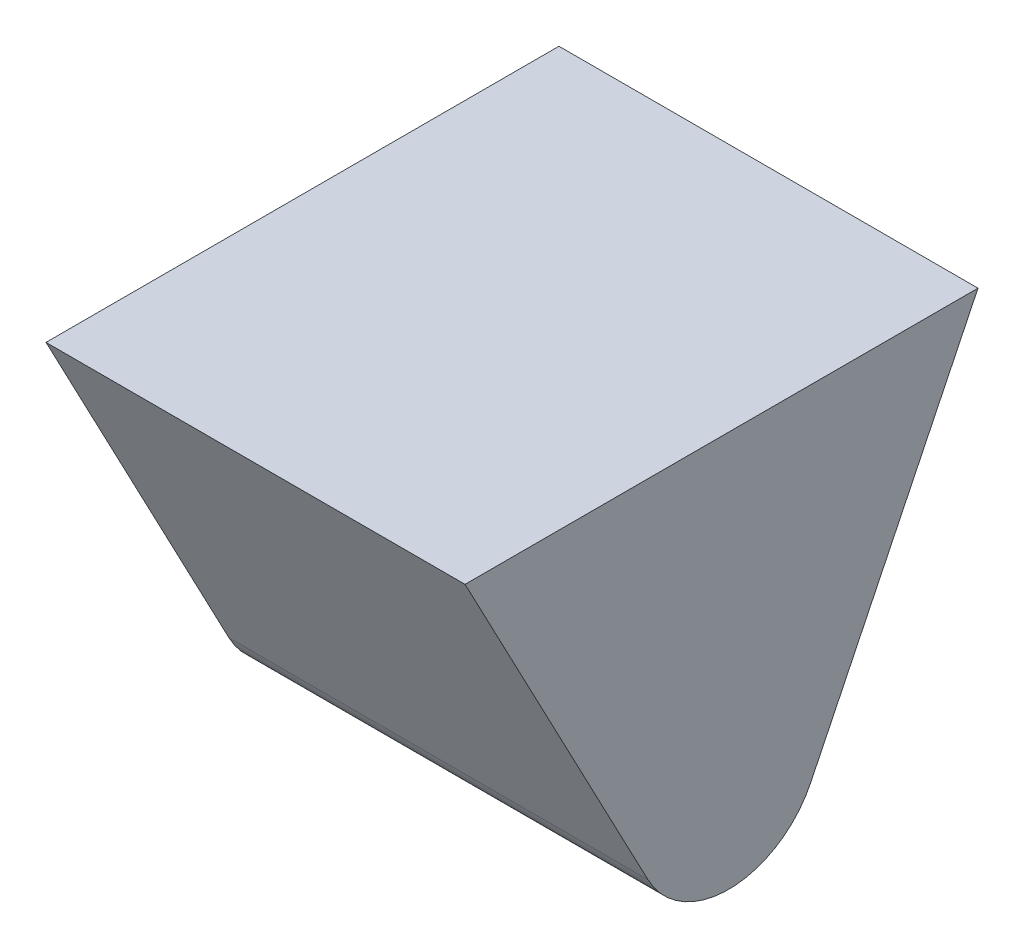
ISO-10303-21;
HEADER;
FILE_DESCRIPTION(('STEP AP214'),'2;1');
FILE_NAME('part.step','',(''),(''),'','','');
FILE_SCHEMA(('AUTOMOTIVE_DESIGN { 1 0 10303 214 1 1 1 1 }'));
ENDSEC;
DATA;
#1=APPLICATION_CONTEXT('core data for automotive mechanical design processes');
#2=APPLICATION_PROTOCOL_DEFINITION('international standard','automotive_design',2000,#1);
#3=PRODUCT_CONTEXT('',#1,'mechanical');
#4=PRODUCT('Part','Part','',(#3));
#5=PRODUCT_RELATED_PRODUCT_CATEGORY('part','',(#4));
#6=PRODUCT_DEFINITION_FORMATION('','',#4);
#7=PRODUCT_DEFINITION_CONTEXT('part definition',#1,'design');
#8=PRODUCT_DEFINITION('design','',#6,#7);
#9=PRODUCT_DEFINITION_SHAPE('','',#8);
#10=(LENGTH_UNIT() NAMED_UNIT(*) SI_UNIT(.MILLI.,.METRE.));
#11=(NAMED_UNIT(*) PLANE_ANGLE_UNIT() SI_UNIT($,.RADIAN.));
#12=(NAMED_UNIT(*) SI_UNIT($,.STERADIAN.) SOLID_ANGLE_UNIT());
#13=UNCERTAINTY_MEASURE_WITH_UNIT(LENGTH_MEASURE(1.E-05),#10,'distance_accuracy_value','');
#14=(GEOMETRIC_REPRESENTATION_CONTEXT(3) GLOBAL_UNCERTAINTY_ASSIGNED_CONTEXT((#13)) GLOBAL_UNIT_ASSIGNED_CONTEXT((#10,
#11,#12)) REPRESENTATION_CONTEXT('',''));
#15=CARTESIAN_POINT('',(0.,0.,0.));
#16=DIRECTION('',(0.,0.,1.));
#17=DIRECTION('',(1.,0.,0.));
#18=AXIS2_PLACEMENT_3D('',#15,#16,#17);
#19=CARTESIAN_POINT('',(5.842,0.,6.13902899916771));
#20=DIRECTION('',(0.,0.466068740050937,-0.88474851203454));
#21=DIRECTION('',(0.,0.88474851203454,0.466068740050937));
#22=AXIS2_PLACEMENT_3D('',#19,#20,#21);
#23=PLANE('',#22);
#24=DIRECTION('',(0.,-0.88474851203454,-0.466068740050937));
#25=VECTOR('',#24,1.);
#26=CARTESIAN_POINT('',(0.,0.,6.13902899916771));
#27=LINE('',#26,#25);
#28=CARTESIAN_POINT('',(0.,7.06414097509893,9.86028451870005));
#29=VERTEX_POINT('',#28);
#30=CARTESIAN_POINT('',(0.,2.22071213786441,7.30885804553731));
#31=VERTEX_POINT('',#30);
#32=EDGE_CURVE('E111',#29,#31,#27,.T.);
#33=ORIENTED_EDGE('',*,*,#32,.T.);
#34=DIRECTION('',(-1.,0.,0.));
#35=VECTOR('',#34,1.);
#36=CARTESIAN_POINT('',(5.842,2.22071213786441,7.30885804553731));
#37=LINE('',#36,#35);
#38=CARTESIAN_POINT('',(5.842,2.22071213786441,7.30885804553731));
#39=VERTEX_POINT('',#38);
#40=EDGE_CURVE('E48',#31,#39,#37,.F.);
#41=ORIENTED_EDGE('',*,*,#40,.T.);
#42=DIRECTION('',(0.,-0.88474851203454,-0.466068740050937));
#43=VECTOR('',#42,1.);
#44=CARTESIAN_POINT('',(5.842,0.,6.13902899916771));
#45=LINE('',#44,#43);
#46=CARTESIAN_POINT('',(5.842,7.06414097509893,9.86028451870005));
#47=VERTEX_POINT('',#46);
#48=EDGE_CURVE('E91',#47,#39,#45,.T.);
#49=ORIENTED_EDGE('',*,*,#48,.F.);
#50=DIRECTION('',(-1.,0.,0.));
#51=VECTOR('',#50,1.);
#52=CARTESIAN_POINT('',(5.842,7.06414097509893,9.86028451870005));
#53=LINE('',#52,#51);
#54=EDGE_CURVE('E101',#47,#29,#53,.T.);
#55=ORIENTED_EDGE('',*,*,#54,.T.);
#56=EDGE_LOOP('',(#33,#41,#49,#55));
#57=FACE_BOUND('',#56,.T.);
#58=ADVANCED_FACE('F39',(#57),#23,.F.);
#59=CARTESIAN_POINT('',(5.842,7.06414097509893,2.70926766954878));
#60=DIRECTION('',(0.,0.43676044242451,0.899577854292304));
#61=DIRECTION('',(0.,-0.899577854292304,0.43676044242451));
#62=AXIS2_PLACEMENT_3D('',#59,#60,#61);
#63=PLANE('',#62);
#64=DIRECTION('',(0.,0.899577854292304,-0.43676044242451));
#65=VECTOR('',#64,1.);
#66=CARTESIAN_POINT('',(5.842,7.06414097509893,2.70926766954878));
#67=LINE('',#66,#65);
#68=CARTESIAN_POINT('',(5.842,2.25793367584997,5.04276356030222));
#69=VERTEX_POINT('',#68);
#70=CARTESIAN_POINT('',(5.842,7.06414097509893,2.70926766954878));
#71=VERTEX_POINT('',#70);
#72=EDGE_CURVE('E80',#69,#71,#67,.T.);
#73=ORIENTED_EDGE('',*,*,#72,.F.);
#74=DIRECTION('',(-1.,0.,0.));
#75=VECTOR('',#74,1.);
#76=CARTESIAN_POINT('',(5.842,2.25793367584997,5.04276356030222));
#77=LINE('',#76,#75);
#78=CARTESIAN_POINT('',(0.,2.25793367584997,5.04276356030222));
#79=VERTEX_POINT('',#78);
#80=EDGE_CURVE('E100',#69,#79,#77,.T.);
#81=ORIENTED_EDGE('',*,*,#80,.T.);
#82=DIRECTION('',(0.,0.899577854292304,-0.43676044242451));
#83=VECTOR('',#82,1.);
#84=CARTESIAN_POINT('',(0.,7.06414097509893,2.70926766954878));
#85=LINE('',#84,#83);
#86=CARTESIAN_POINT('',(0.,7.06414097509893,2.70926766954878));
#87=VERTEX_POINT('',#86);
#88=EDGE_CURVE('E96',#79,#87,#85,.T.);
#89=ORIENTED_EDGE('',*,*,#88,.T.);
#90=DIRECTION('',(-1.,0.,0.));
#91=VECTOR('',#90,1.);
#92=CARTESIAN_POINT('',(5.842,7.06414097509893,2.70926766954878));
#93=LINE('',#92,#91);
#94=EDGE_CURVE('E94',#71,#87,#93,.T.);
#95=ORIENTED_EDGE('',*,*,#94,.F.);
#96=EDGE_LOOP('',(#73,#81,#89,#95));
#97=FACE_BOUND('',#96,.T.);
#98=ADVANCED_FACE('F95',(#97),#63,.F.);
#99=CARTESIAN_POINT('',(5.842,7.06414097509893,9.86028451870005));
#100=DIRECTION('',(0.,-1.,0.));
#101=DIRECTION('',(0.,0.,-1.));
#102=AXIS2_PLACEMENT_3D('',#99,#100,#101);
#103=PLANE('',#102);
#104=DIRECTION('',(0.,0.,1.));
#105=VECTOR('',#104,1.);
#106=CARTESIAN_POINT('',(0.,7.06414097509893,9.86028451870005));
#107=LINE('',#106,#105);
#108=EDGE_CURVE('E116',#87,#29,#107,.T.);
#109=ORIENTED_EDGE('',*,*,#108,.T.);
#110=ORIENTED_EDGE('',*,*,#54,.F.);
#111=DIRECTION('',(0.,0.,1.));
#112=VECTOR('',#111,1.);
#113=CARTESIAN_POINT('',(5.842,7.06414097509893,9.86028451870005));
#114=LINE('',#113,#112);
#115=EDGE_CURVE('E84',#71,#47,#114,.T.);
#116=ORIENTED_EDGE('',*,*,#115,.F.);
#117=ORIENTED_EDGE('',*,*,#94,.T.);
#118=EDGE_LOOP('',(#109,#110,#116,#117));
#119=FACE_BOUND('',#118,.T.);
#120=ADVANCED_FACE('F103',(#119),#103,.F.);
#121=CARTESIAN_POINT('',(5.842,0.,0.));
#122=DIRECTION('',(-1.,0.,0.));
#123=DIRECTION('',(0.,0.,1.));
#124=AXIS2_PLACEMENT_3D('',#121,#122,#123);
#125=PLANE('',#124);
#126=ORIENTED_EDGE('',*,*,#48,.T.);
#127=CARTESIAN_POINT('',(5.842,2.8126194377291,6.18522743525344));
#128=DIRECTION('',(-1.,0.,0.));
#129=DIRECTION('',(0.,0.,1.));
#130=AXIS2_PLACEMENT_3D('',#127,#128,#129);
#131=CIRCLE('',#130,1.27);
#132=EDGE_CURVE('E11',#39,#69,#131,.F.);
#133=ORIENTED_EDGE('',*,*,#132,.T.);
#134=ORIENTED_EDGE('',*,*,#72,.T.);
#135=ORIENTED_EDGE('',*,*,#115,.T.);
#136=EDGE_LOOP('',(#126,#133,#134,#135));
#137=FACE_BOUND('',#136,.T.);
#138=ADVANCED_FACE('F82',(#137),#125,.F.);
#139=CARTESIAN_POINT('',(0.,0.,0.));
#140=DIRECTION('',(-1.,0.,0.));
#141=DIRECTION('',(0.,0.,1.));
#142=AXIS2_PLACEMENT_3D('',#139,#140,#141);
#143=PLANE('',#142);
#144=ORIENTED_EDGE('',*,*,#88,.F.);
#145=CARTESIAN_POINT('',(0.,2.8126194377291,6.18522743525344));
#146=DIRECTION('',(-1.,0.,0.));
#147=DIRECTION('',(0.,0.,1.));
#148=AXIS2_PLACEMENT_3D('',#145,#146,#147);
#149=CIRCLE('',#148,1.27);
#150=EDGE_CURVE('E62',#79,#31,#149,.T.);
#151=ORIENTED_EDGE('',*,*,#150,.T.);
#152=ORIENTED_EDGE('',*,*,#32,.F.);
#153=ORIENTED_EDGE('',*,*,#108,.F.);
#154=EDGE_LOOP('',(#144,#151,#152,#153));
#155=FACE_BOUND('',#154,.T.);
#156=ADVANCED_FACE('F124',(#155),#143,.T.);
#157=CARTESIAN_POINT('',(5.842,2.8126194377291,6.18522743525344));
#158=DIRECTION('',(-1.,0.,0.));
#159=DIRECTION('',(0.,0.,1.));
#160=AXIS2_PLACEMENT_3D('',#157,#158,#159);
#161=CYLINDRICAL_SURFACE('',#160,1.27);
#162=ORIENTED_EDGE('',*,*,#132,.F.);
#163=ORIENTED_EDGE('',*,*,#40,.F.);
#164=ORIENTED_EDGE('',*,*,#150,.F.);
#165=ORIENTED_EDGE('',*,*,#80,.F.);
#166=EDGE_LOOP('',(#162,#163,#164,#165));
#167=FACE_BOUND('',#166,.T.);
#168=ADVANCED_FACE('F41',(#167),#161,.T.);
#169=CLOSED_SHELL('',(#58,#98,#120,#138,#156,#168));
#170=MANIFOLD_SOLID_BREP('B2',#169);
#171=ADVANCED_BREP_SHAPE_REPRESENTATION('',(#18,#170),#14);
#172=SHAPE_DEFINITION_REPRESENTATION(#9,#171);
ENDSEC;
END-ISO-10303-21;
